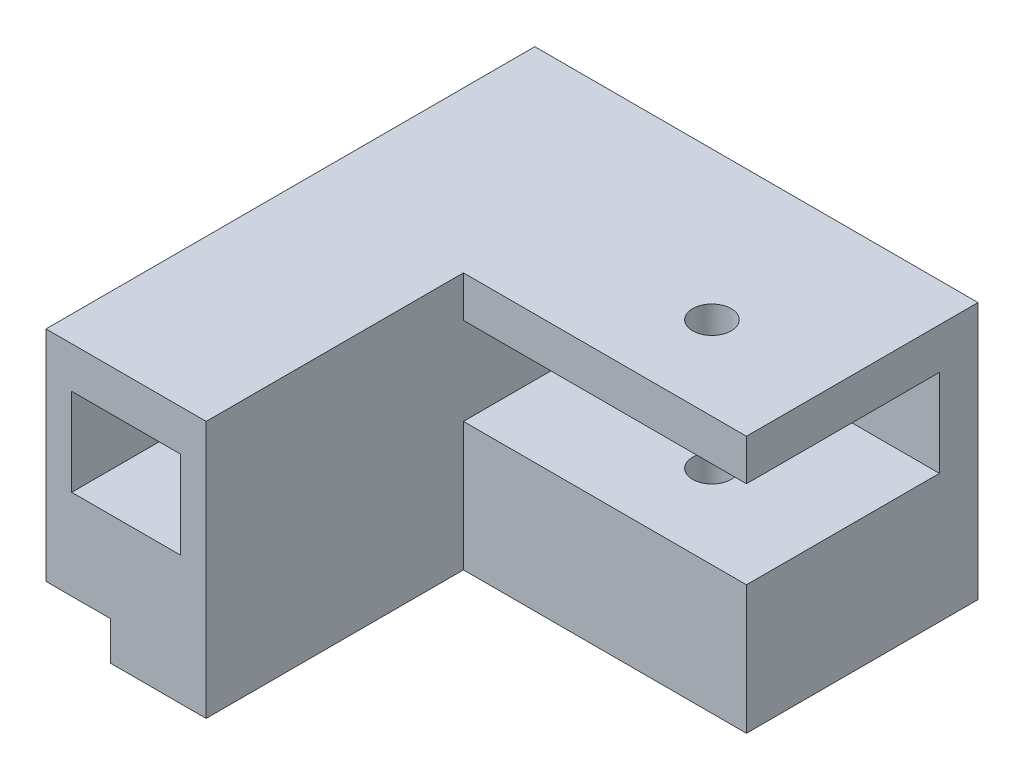
ISO-10303-21;
HEADER;
FILE_DESCRIPTION(('STEP AP214'),'2;1');
FILE_NAME('part.step','',(''),(''),'','','');
FILE_SCHEMA(('AUTOMOTIVE_DESIGN { 1 0 10303 214 1 1 1 1 }'));
ENDSEC;
DATA;
#1=APPLICATION_CONTEXT('core data for automotive mechanical design processes');
#2=APPLICATION_PROTOCOL_DEFINITION('international standard','automotive_design',2000,#1);
#3=PRODUCT_CONTEXT('',#1,'mechanical');
#4=PRODUCT('Part','Part','',(#3));
#5=PRODUCT_RELATED_PRODUCT_CATEGORY('part','',(#4));
#6=PRODUCT_DEFINITION_FORMATION('','',#4);
#7=PRODUCT_DEFINITION_CONTEXT('part definition',#1,'design');
#8=PRODUCT_DEFINITION('design','',#6,#7);
#9=PRODUCT_DEFINITION_SHAPE('','',#8);
#10=(LENGTH_UNIT() NAMED_UNIT(*) SI_UNIT(.MILLI.,.METRE.));
#11=(NAMED_UNIT(*) PLANE_ANGLE_UNIT() SI_UNIT($,.RADIAN.));
#12=(NAMED_UNIT(*) SI_UNIT($,.STERADIAN.) SOLID_ANGLE_UNIT());
#13=UNCERTAINTY_MEASURE_WITH_UNIT(LENGTH_MEASURE(1.E-05),#10,'distance_accuracy_value','');
#14=(GEOMETRIC_REPRESENTATION_CONTEXT(3) GLOBAL_UNCERTAINTY_ASSIGNED_CONTEXT((#13)) GLOBAL_UNIT_ASSIGNED_CONTEXT((#10,
#11,#12)) REPRESENTATION_CONTEXT('',''));
#15=CARTESIAN_POINT('',(0.,0.,0.));
#16=DIRECTION('',(0.,0.,1.));
#17=DIRECTION('',(1.,0.,0.));
#18=AXIS2_PLACEMENT_3D('',#15,#16,#17);
#19=CARTESIAN_POINT('',(0.,5.,18.));
#20=DIRECTION('',(0.,1.,0.));
#21=DIRECTION('',(0.,0.,-1.));
#22=AXIS2_PLACEMENT_3D('',#19,#20,#21);
#23=PLANE('',#22);
#24=DIRECTION('',(-1.,0.,0.));
#25=VECTOR('',#24,1.);
#26=CARTESIAN_POINT('',(0.,5.,15.9436413169626));
#27=LINE('',#26,#25);
#28=CARTESIAN_POINT('',(-4.375,4.99999999986514,15.9436413171899));
#29=VERTEX_POINT('',#28);
#30=CARTESIAN_POINT('',(-12.825,4.99999999995493,15.9436413170386));
#31=VERTEX_POINT('',#30);
#32=EDGE_CURVE('E212',#29,#31,#27,.T.);
#33=ORIENTED_EDGE('',*,*,#32,.T.);
#34=DIRECTION('',(0.,0.,1.));
#35=VECTOR('',#34,1.);
#36=CARTESIAN_POINT('',(-12.825,5.,38.));
#37=LINE('',#36,#35);
#38=CARTESIAN_POINT('',(-12.825,5.,38.));
#39=VERTEX_POINT('',#38);
#40=EDGE_CURVE('E252',#31,#39,#37,.T.);
#41=ORIENTED_EDGE('',*,*,#40,.T.);
#42=DIRECTION('',(-1.,0.,0.));
#43=VECTOR('',#42,1.);
#44=CARTESIAN_POINT('',(0.,5.,38.));
#45=LINE('',#44,#43);
#46=CARTESIAN_POINT('',(-4.375,5.,38.));
#47=VERTEX_POINT('',#46);
#48=EDGE_CURVE('E361',#47,#39,#45,.T.);
#49=ORIENTED_EDGE('',*,*,#48,.F.);
#50=DIRECTION('',(0.,0.,-1.));
#51=VECTOR('',#50,1.);
#52=CARTESIAN_POINT('',(-4.37500000000001,5.,38.));
#53=LINE('',#52,#51);
#54=EDGE_CURVE('E293',#47,#29,#53,.T.);
#55=ORIENTED_EDGE('',*,*,#54,.T.);
#56=EDGE_LOOP('',(#33,#41,#49,#55));
#57=FACE_BOUND('',#56,.T.);
#58=ADVANCED_FACE('F37',(#57),#23,.T.);
#59=CARTESIAN_POINT('',(10.44201924,5.,11.5));
#60=DIRECTION('',(0.,-1.,0.));
#61=DIRECTION('',(0.,0.,-1.));
#62=AXIS2_PLACEMENT_3D('',#59,#60,#61);
#63=CIRCLE('',#62,1.5);
#64=CARTESIAN_POINT('',(10.44201924,5.,10.));
#65=VERTEX_POINT('',#64);
#66=EDGE_CURVE('E323',#65,#65,#63,.F.);
#67=ORIENTED_EDGE('',*,*,#66,.F.);
#68=EDGE_LOOP('',(#67));
#69=FACE_BOUND('',#68,.T.);
#70=DIRECTION('',(0.,0.,-1.));
#71=VECTOR('',#70,1.);
#72=CARTESIAN_POINT('',(12.125,4.99999999999545,0.));
#73=LINE('',#72,#71);
#74=CARTESIAN_POINT('',(12.125,4.99999999999545,3.));
#75=VERTEX_POINT('',#74);
#76=CARTESIAN_POINT('',(12.125,4.99999999999545,0.));
#77=VERTEX_POINT('',#76);
#78=EDGE_CURVE('E249',#75,#77,#73,.T.);
#79=ORIENTED_EDGE('',*,*,#78,.T.);
#80=DIRECTION('',(-1.,0.,0.));
#81=VECTOR('',#80,1.);
#82=CARTESIAN_POINT('',(0.,5.,0.));
#83=LINE('',#82,#81);
#84=CARTESIAN_POINT('',(-2.375,5.,0.));
#85=VERTEX_POINT('',#84);
#86=EDGE_CURVE('E380',#77,#85,#83,.T.);
#87=ORIENTED_EDGE('',*,*,#86,.T.);
#88=DIRECTION('',(0.,0.,1.));
#89=VECTOR('',#88,1.);
#90=CARTESIAN_POINT('',(-2.37500000000001,5.,38.));
#91=LINE('',#90,#89);
#92=CARTESIAN_POINT('',(-2.375,5.,18.));
#93=VERTEX_POINT('',#92);
#94=EDGE_CURVE('E316',#85,#93,#91,.T.);
#95=ORIENTED_EDGE('',*,*,#94,.T.);
#96=DIRECTION('',(-1.,0.,0.));
#97=VECTOR('',#96,1.);
#98=CARTESIAN_POINT('',(0.,5.,18.));
#99=LINE('',#98,#97);
#100=CARTESIAN_POINT('',(19.625,5.,18.));
#101=VERTEX_POINT('',#100);
#102=EDGE_CURVE('E460',#101,#93,#99,.T.);
#103=ORIENTED_EDGE('',*,*,#102,.F.);
#104=DIRECTION('',(0.,0.,-1.));
#105=VECTOR('',#104,1.);
#106=CARTESIAN_POINT('',(19.625,5.,0.));
#107=LINE('',#106,#105);
#108=CARTESIAN_POINT('',(19.625,4.99999999999545,3.));
#109=VERTEX_POINT('',#108);
#110=EDGE_CURVE('E333',#101,#109,#107,.T.);
#111=ORIENTED_EDGE('',*,*,#110,.T.);
#112=DIRECTION('',(-1.,0.,0.));
#113=VECTOR('',#112,1.);
#114=CARTESIAN_POINT('',(19.625,4.99999999999545,3.));
#115=LINE('',#114,#113);
#116=EDGE_CURVE('E246',#109,#75,#115,.T.);
#117=ORIENTED_EDGE('',*,*,#116,.T.);
#118=EDGE_LOOP('',(#79,#87,#95,#103,#111,#117));
#119=FACE_BOUND('',#118,.T.);
#120=ADVANCED_FACE('F471',(#69,#119),#23,.T.);
#121=CARTESIAN_POINT('',(0.,11.8,18.));
#122=DIRECTION('',(0.,1.,0.));
#123=DIRECTION('',(0.,0.,-1.));
#124=AXIS2_PLACEMENT_3D('',#121,#122,#123);
#125=PLANE('',#124);
#126=CARTESIAN_POINT('',(10.44201924,11.8,11.5));
#127=DIRECTION('',(0.,-1.,0.));
#128=DIRECTION('',(0.,0.,-1.));
#129=AXIS2_PLACEMENT_3D('',#126,#127,#128);
#130=CIRCLE('',#129,1.5);
#131=CARTESIAN_POINT('',(10.44201924,11.8,10.));
#132=VERTEX_POINT('',#131);
#133=EDGE_CURVE('E265',#132,#132,#130,.F.);
#134=ORIENTED_EDGE('',*,*,#133,.T.);
#135=EDGE_LOOP('',(#134));
#136=FACE_BOUND('',#135,.T.);
#137=DIRECTION('',(1.,0.,0.));
#138=VECTOR('',#137,1.);
#139=CARTESIAN_POINT('',(19.625,11.8,3.));
#140=LINE('',#139,#138);
#141=CARTESIAN_POINT('',(12.125,11.8,3.));
#142=VERTEX_POINT('',#141);
#143=CARTESIAN_POINT('',(19.625,11.8,3.));
#144=VERTEX_POINT('',#143);
#145=EDGE_CURVE('E233',#142,#144,#140,.T.);
#146=ORIENTED_EDGE('',*,*,#145,.T.);
#147=DIRECTION('',(0.,0.,1.));
#148=VECTOR('',#147,1.);
#149=CARTESIAN_POINT('',(19.625,11.8,0.));
#150=LINE('',#149,#148);
#151=CARTESIAN_POINT('',(19.625,11.8,18.));
#152=VERTEX_POINT('',#151);
#153=EDGE_CURVE('E268',#144,#152,#150,.T.);
#154=ORIENTED_EDGE('',*,*,#153,.T.);
#155=DIRECTION('',(-1.,0.,0.));
#156=VECTOR('',#155,1.);
#157=CARTESIAN_POINT('',(0.,11.8,18.));
#158=LINE('',#157,#156);
#159=CARTESIAN_POINT('',(-2.375,11.7999999999938,18.));
#160=VERTEX_POINT('',#159);
#161=EDGE_CURVE('E426',#152,#160,#158,.T.);
#162=ORIENTED_EDGE('',*,*,#161,.T.);
#163=DIRECTION('',(0.,0.,1.));
#164=VECTOR('',#163,1.);
#165=CARTESIAN_POINT('',(-2.37500000000001,11.7999999999938,38.));
#166=LINE('',#165,#164);
#167=CARTESIAN_POINT('',(-2.375,11.7999999999938,0.));
#168=VERTEX_POINT('',#167);
#169=EDGE_CURVE('E301',#168,#160,#166,.T.);
#170=ORIENTED_EDGE('',*,*,#169,.F.);
#171=DIRECTION('',(-1.,0.,0.));
#172=VECTOR('',#171,1.);
#173=CARTESIAN_POINT('',(0.,11.8,0.));
#174=LINE('',#173,#172);
#175=CARTESIAN_POINT('',(12.125,11.8,0.));
#176=VERTEX_POINT('',#175);
#177=EDGE_CURVE('E404',#176,#168,#174,.T.);
#178=ORIENTED_EDGE('',*,*,#177,.F.);
#179=DIRECTION('',(0.,0.,1.));
#180=VECTOR('',#179,1.);
#181=CARTESIAN_POINT('',(12.125,11.8,0.));
#182=LINE('',#181,#180);
#183=EDGE_CURVE('E236',#176,#142,#182,.T.);
#184=ORIENTED_EDGE('',*,*,#183,.T.);
#185=EDGE_LOOP('',(#146,#154,#162,#170,#178,#184));
#186=FACE_BOUND('',#185,.T.);
#187=ADVANCED_FACE('F490',(#136,#186),#125,.F.);
#188=DIRECTION('',(-1.,0.,0.));
#189=VECTOR('',#188,1.);
#190=CARTESIAN_POINT('',(11.4417453763892,5.,3.61207246935829));
#191=LINE('',#190,#189);
#192=CARTESIAN_POINT('',(-12.825,5.,3.61207246935829));
#193=VERTEX_POINT('',#192);
#194=CARTESIAN_POINT('',(-4.375,5.,3.61207246935829));
#195=VERTEX_POINT('',#194);
#196=EDGE_CURVE('E225',#193,#195,#191,.F.);
#197=ORIENTED_EDGE('',*,*,#196,.T.);
#198=CARTESIAN_POINT('',(-4.375,5.,0.));
#199=VERTEX_POINT('',#198);
#200=EDGE_CURVE('E41',#195,#199,#53,.T.);
#201=ORIENTED_EDGE('',*,*,#200,.T.);
#202=CARTESIAN_POINT('',(-12.825,5.,0.));
#203=VERTEX_POINT('',#202);
#204=EDGE_CURVE('E369',#199,#203,#83,.T.);
#205=ORIENTED_EDGE('',*,*,#204,.T.);
#206=EDGE_CURVE('E253',#203,#193,#37,.T.);
#207=ORIENTED_EDGE('',*,*,#206,.T.);
#208=EDGE_LOOP('',(#197,#201,#205,#207));
#209=FACE_BOUND('',#208,.T.);
#210=ADVANCED_FACE('F39',(#209),#23,.T.);
#211=DIRECTION('',(0.,0.,1.));
#212=VECTOR('',#211,1.);
#213=CARTESIAN_POINT('',(-12.825,11.7999999999938,38.));
#214=LINE('',#213,#212);
#215=CARTESIAN_POINT('',(-12.825,11.7999999999938,0.));
#216=VERTEX_POINT('',#215);
#217=CARTESIAN_POINT('',(-12.825,11.7999999999938,38.));
#218=VERTEX_POINT('',#217);
#219=EDGE_CURVE('E258',#216,#218,#214,.T.);
#220=ORIENTED_EDGE('',*,*,#219,.F.);
#221=CARTESIAN_POINT('',(-4.375,11.8,0.));
#222=VERTEX_POINT('',#221);
#223=EDGE_CURVE('E284',#222,#216,#174,.T.);
#224=ORIENTED_EDGE('',*,*,#223,.F.);
#225=DIRECTION('',(0.,0.,-1.));
#226=VECTOR('',#225,1.);
#227=CARTESIAN_POINT('',(-4.37500000000001,11.7999999999938,38.));
#228=LINE('',#227,#226);
#229=CARTESIAN_POINT('',(-4.37500000000001,11.7999999999938,38.));
#230=VERTEX_POINT('',#229);
#231=EDGE_CURVE('E311',#230,#222,#228,.T.);
#232=ORIENTED_EDGE('',*,*,#231,.F.);
#233=DIRECTION('',(-1.,0.,0.));
#234=VECTOR('',#233,1.);
#235=CARTESIAN_POINT('',(0.,11.8,38.));
#236=LINE('',#235,#234);
#237=EDGE_CURVE('E276',#230,#218,#236,.T.);
#238=ORIENTED_EDGE('',*,*,#237,.T.);
#239=EDGE_LOOP('',(#220,#224,#232,#238));
#240=FACE_BOUND('',#239,.T.);
#241=ADVANCED_FACE('F403',(#240),#125,.F.);
#242=CARTESIAN_POINT('',(0.,-2.,38.));
#243=DIRECTION('',(0.,-1.,0.));
#244=DIRECTION('',(0.,0.,1.));
#245=AXIS2_PLACEMENT_3D('',#242,#243,#244);
#246=PLANE('',#245);
#247=DIRECTION('',(0.,0.,-1.));
#248=VECTOR('',#247,1.);
#249=CARTESIAN_POINT('',(-9.825,-2.,38.));
#250=LINE('',#249,#248);
#251=CARTESIAN_POINT('',(-9.825,-2.,38.));
#252=VERTEX_POINT('',#251);
#253=CARTESIAN_POINT('',(-9.825,-2.,10.));
#254=VERTEX_POINT('',#253);
#255=EDGE_CURVE('E455',#252,#254,#250,.T.);
#256=ORIENTED_EDGE('',*,*,#255,.F.);
#257=DIRECTION('',(1.,0.,0.));
#258=VECTOR('',#257,1.);
#259=CARTESIAN_POINT('',(0.,-2.,38.));
#260=LINE('',#259,#258);
#261=CARTESIAN_POINT('',(-14.825,-2.,38.));
#262=VERTEX_POINT('',#261);
#263=EDGE_CURVE('E351',#262,#252,#260,.T.);
#264=ORIENTED_EDGE('',*,*,#263,.F.);
#265=DIRECTION('',(0.,0.,-1.));
#266=VECTOR('',#265,1.);
#267=CARTESIAN_POINT('',(-14.825,-2.,38.));
#268=LINE('',#267,#266);
#269=CARTESIAN_POINT('',(-14.825,-2.,10.));
#270=VERTEX_POINT('',#269);
#271=EDGE_CURVE('E381',#262,#270,#268,.T.);
#272=ORIENTED_EDGE('',*,*,#271,.T.);
#273=DIRECTION('',(1.,0.,0.));
#274=VECTOR('',#273,1.);
#275=CARTESIAN_POINT('',(0.,-2.,10.));
#276=LINE('',#275,#274);
#277=EDGE_CURVE('E339',#270,#254,#276,.T.);
#278=ORIENTED_EDGE('',*,*,#277,.T.);
#279=EDGE_LOOP('',(#256,#264,#272,#278));
#280=FACE_BOUND('',#279,.T.);
#281=ADVANCED_FACE('F507',(#280),#246,.T.);
#282=CARTESIAN_POINT('',(-9.825,0.,38.));
#283=DIRECTION('',(-1.,0.,0.));
#284=DIRECTION('',(0.,0.,-1.));
#285=AXIS2_PLACEMENT_3D('',#282,#283,#284);
#286=PLANE('',#285);
#287=DIRECTION('',(0.,0.,-1.));
#288=VECTOR('',#287,1.);
#289=CARTESIAN_POINT('',(-9.825,-5.,38.));
#290=LINE('',#289,#288);
#291=CARTESIAN_POINT('',(-9.825,-5.,38.));
#292=VERTEX_POINT('',#291);
#293=CARTESIAN_POINT('',(-9.825,-5.,10.));
#294=VERTEX_POINT('',#293);
#295=EDGE_CURVE('E450',#292,#294,#290,.T.);
#296=ORIENTED_EDGE('',*,*,#295,.F.);
#297=DIRECTION('',(0.,-1.,0.));
#298=VECTOR('',#297,1.);
#299=CARTESIAN_POINT('',(-9.825,0.,38.));
#300=LINE('',#299,#298);
#301=EDGE_CURVE('E354',#252,#292,#300,.T.);
#302=ORIENTED_EDGE('',*,*,#301,.F.);
#303=ORIENTED_EDGE('',*,*,#255,.T.);
#304=DIRECTION('',(0.,-1.,0.));
#305=VECTOR('',#304,1.);
#306=CARTESIAN_POINT('',(-9.825,0.,10.));
#307=LINE('',#306,#305);
#308=EDGE_CURVE('E336',#254,#294,#307,.T.);
#309=ORIENTED_EDGE('',*,*,#308,.T.);
#310=EDGE_LOOP('',(#296,#302,#303,#309));
#311=FACE_BOUND('',#310,.T.);
#312=ADVANCED_FACE('F510',(#311),#286,.T.);
#313=CARTESIAN_POINT('',(0.,-5.,18.));
#314=DIRECTION('',(0.,1.,0.));
#315=DIRECTION('',(-1.,0.,0.));
#316=AXIS2_PLACEMENT_3D('',#313,#314,#315);
#317=PLANE('',#316);
#318=CARTESIAN_POINT('',(10.44201924,-5.,11.5));
#319=DIRECTION('',(0.,-1.,0.));
#320=DIRECTION('',(-1.,0.,0.));
#321=AXIS2_PLACEMENT_3D('',#318,#319,#320);
#322=CIRCLE('',#321,1.5);
#323=CARTESIAN_POINT('',(8.94201924000001,-5.,11.5));
#324=VERTEX_POINT('',#323);
#325=EDGE_CURVE('E320',#324,#324,#322,.F.);
#326=ORIENTED_EDGE('',*,*,#325,.T.);
#327=EDGE_LOOP('',(#326));
#328=FACE_BOUND('',#327,.T.);
#329=DIRECTION('',(-1.,0.,0.));
#330=VECTOR('',#329,1.);
#331=CARTESIAN_POINT('',(0.,-5.,0.));
#332=LINE('',#331,#330);
#333=CARTESIAN_POINT('',(19.625,-5.,0.));
#334=VERTEX_POINT('',#333);
#335=CARTESIAN_POINT('',(-14.825,-5.,0.));
#336=VERTEX_POINT('',#335);
#337=EDGE_CURVE('E442',#334,#336,#332,.T.);
#338=ORIENTED_EDGE('',*,*,#337,.F.);
#339=DIRECTION('',(0.,0.,1.));
#340=VECTOR('',#339,1.);
#341=CARTESIAN_POINT('',(19.625,-5.,0.));
#342=LINE('',#341,#340);
#343=CARTESIAN_POINT('',(19.625,-5.,18.));
#344=VERTEX_POINT('',#343);
#345=EDGE_CURVE('E328',#334,#344,#342,.T.);
#346=ORIENTED_EDGE('',*,*,#345,.T.);
#347=DIRECTION('',(-1.,0.,0.));
#348=VECTOR('',#347,1.);
#349=CARTESIAN_POINT('',(0.,-5.,18.));
#350=LINE('',#349,#348);
#351=CARTESIAN_POINT('',(-2.375,-5.,18.));
#352=VERTEX_POINT('',#351);
#353=EDGE_CURVE('E11',#344,#352,#350,.T.);
#354=ORIENTED_EDGE('',*,*,#353,.T.);
#355=DIRECTION('',(0.,0.,-1.));
#356=VECTOR('',#355,1.);
#357=CARTESIAN_POINT('',(-2.375,-5.,38.));
#358=LINE('',#357,#356);
#359=CARTESIAN_POINT('',(-2.375,-5.,38.));
#360=VERTEX_POINT('',#359);
#361=EDGE_CURVE('E447',#360,#352,#358,.T.);
#362=ORIENTED_EDGE('',*,*,#361,.F.);
#363=DIRECTION('',(-1.,0.,0.));
#364=VECTOR('',#363,1.);
#365=CARTESIAN_POINT('',(0.,-5.,38.));
#366=LINE('',#365,#364);
#367=EDGE_CURVE('E357',#360,#292,#366,.T.);
#368=ORIENTED_EDGE('',*,*,#367,.T.);
#369=ORIENTED_EDGE('',*,*,#295,.T.);
#370=DIRECTION('',(-1.,0.,0.));
#371=VECTOR('',#370,1.);
#372=CARTESIAN_POINT('',(0.,-5.,10.));
#373=LINE('',#372,#371);
#374=CARTESIAN_POINT('',(-14.825,-5.,10.));
#375=VERTEX_POINT('',#374);
#376=EDGE_CURVE('E344',#294,#375,#373,.T.);
#377=ORIENTED_EDGE('',*,*,#376,.T.);
#378=DIRECTION('',(0.,0.,-1.));
#379=VECTOR('',#378,1.);
#380=CARTESIAN_POINT('',(-14.825,-5.,10.));
#381=LINE('',#380,#379);
#382=EDGE_CURVE('E347',#375,#336,#381,.T.);
#383=ORIENTED_EDGE('',*,*,#382,.T.);
#384=EDGE_LOOP('',(#338,#346,#354,#362,#368,#369,#377,#383));
#385=FACE_BOUND('',#384,.T.);
#386=ADVANCED_FACE('F485',(#328,#385),#317,.F.);
#387=CARTESIAN_POINT('',(0.,0.,18.));
#388=DIRECTION('',(0.,0.,-1.));
#389=DIRECTION('',(1.,0.,0.));
#390=AXIS2_PLACEMENT_3D('',#387,#388,#389);
#391=PLANE('',#390);
#392=ORIENTED_EDGE('',*,*,#102,.T.);
#393=DIRECTION('',(0.,-1.,0.));
#394=VECTOR('',#393,1.);
#395=CARTESIAN_POINT('',(-2.375,0.,18.));
#396=LINE('',#395,#394);
#397=EDGE_CURVE('E47',#93,#352,#396,.T.);
#398=ORIENTED_EDGE('',*,*,#397,.T.);
#399=ORIENTED_EDGE('',*,*,#353,.F.);
#400=DIRECTION('',(0.,1.,0.));
#401=VECTOR('',#400,1.);
#402=CARTESIAN_POINT('',(19.625,5.,18.));
#403=LINE('',#402,#401);
#404=EDGE_CURVE('E331',#344,#101,#403,.T.);
#405=ORIENTED_EDGE('',*,*,#404,.T.);
#406=EDGE_LOOP('',(#392,#398,#399,#405));
#407=FACE_BOUND('',#406,.T.);
#408=ADVANCED_FACE('F481',(#407),#391,.F.);
#409=CARTESIAN_POINT('',(0.,0.,0.));
#410=DIRECTION('',(0.,0.,-1.));
#411=DIRECTION('',(1.,0.,0.));
#412=AXIS2_PLACEMENT_3D('',#409,#410,#411);
#413=PLANE('',#412);
#414=DIRECTION('',(0.,1.,0.));
#415=VECTOR('',#414,1.);
#416=CARTESIAN_POINT('',(12.125,-500000.,0.));
#417=LINE('',#416,#415);
#418=EDGE_CURVE('E244',#77,#176,#417,.T.);
#419=ORIENTED_EDGE('',*,*,#418,.T.);
#420=ORIENTED_EDGE('',*,*,#177,.T.);
#421=DIRECTION('',(0.,-1.,0.));
#422=VECTOR('',#421,1.);
#423=CARTESIAN_POINT('',(-2.37500000005515,500000.,0.));
#424=LINE('',#423,#422);
#425=EDGE_CURVE('E296',#168,#85,#424,.T.);
#426=ORIENTED_EDGE('',*,*,#425,.T.);
#427=ORIENTED_EDGE('',*,*,#86,.F.);
#428=EDGE_LOOP('',(#419,#420,#426,#427));
#429=FACE_BOUND('',#428,.T.);
#430=ORIENTED_EDGE('',*,*,#204,.F.);
#431=DIRECTION('',(0.,-1.,0.));
#432=VECTOR('',#431,1.);
#433=CARTESIAN_POINT('',(-4.37500000005515,500000.,0.));
#434=LINE('',#433,#432);
#435=EDGE_CURVE('E302',#222,#199,#434,.T.);
#436=ORIENTED_EDGE('',*,*,#435,.F.);
#437=ORIENTED_EDGE('',*,*,#223,.T.);
#438=DIRECTION('',(0.,-1.,0.));
#439=VECTOR('',#438,1.);
#440=CARTESIAN_POINT('',(-12.8250000000552,500000.,0.));
#441=LINE('',#440,#439);
#442=EDGE_CURVE('E63',#216,#203,#441,.T.);
#443=ORIENTED_EDGE('',*,*,#442,.T.);
#444=EDGE_LOOP('',(#430,#436,#437,#443));
#445=FACE_BOUND('',#444,.T.);
#446=DIRECTION('',(0.,-1.,0.));
#447=VECTOR('',#446,1.);
#448=CARTESIAN_POINT('',(19.625,5.,0.));
#449=LINE('',#448,#447);
#450=CARTESIAN_POINT('',(19.625,15.,0.));
#451=VERTEX_POINT('',#450);
#452=EDGE_CURVE('E326',#451,#334,#449,.T.);
#453=ORIENTED_EDGE('',*,*,#452,.T.);
#454=ORIENTED_EDGE('',*,*,#337,.T.);
#455=DIRECTION('',(0.,1.,0.));
#456=VECTOR('',#455,1.);
#457=CARTESIAN_POINT('',(-14.825,0.,0.));
#458=LINE('',#457,#456);
#459=CARTESIAN_POINT('',(-14.825,15.,0.));
#460=VERTEX_POINT('',#459);
#461=EDGE_CURVE('E350',#336,#460,#458,.T.);
#462=ORIENTED_EDGE('',*,*,#461,.T.);
#463=DIRECTION('',(-1.,0.,0.));
#464=VECTOR('',#463,1.);
#465=CARTESIAN_POINT('',(0.,15.,0.));
#466=LINE('',#465,#464);
#467=EDGE_CURVE('E407',#451,#460,#466,.T.);
#468=ORIENTED_EDGE('',*,*,#467,.F.);
#469=EDGE_LOOP('',(#453,#454,#462,#468));
#470=FACE_BOUND('',#469,.T.);
#471=ADVANCED_FACE('F377',(#429,#445,#470),#413,.T.);
#472=CARTESIAN_POINT('',(-2.375,0.,38.));
#473=DIRECTION('',(-1.,0.,0.));
#474=DIRECTION('',(0.,-1.,0.));
#475=AXIS2_PLACEMENT_3D('',#472,#473,#474);
#476=PLANE('',#475);
#477=DIRECTION('',(0.,-1.,0.));
#478=VECTOR('',#477,1.);
#479=CARTESIAN_POINT('',(-2.375,0.,38.));
#480=LINE('',#479,#478);
#481=CARTESIAN_POINT('',(-2.375,15.,38.));
#482=VERTEX_POINT('',#481);
#483=EDGE_CURVE('E359',#482,#360,#480,.T.);
#484=ORIENTED_EDGE('',*,*,#483,.T.);
#485=ORIENTED_EDGE('',*,*,#361,.T.);
#486=ORIENTED_EDGE('',*,*,#397,.F.);
#487=ORIENTED_EDGE('',*,*,#94,.F.);
#488=ORIENTED_EDGE('',*,*,#425,.F.);
#489=ORIENTED_EDGE('',*,*,#169,.T.);
#490=DIRECTION('',(0.,1.,0.));
#491=VECTOR('',#490,1.);
#492=CARTESIAN_POINT('',(-2.375,0.,18.));
#493=LINE('',#492,#491);
#494=CARTESIAN_POINT('',(-2.375,15.,18.));
#495=VERTEX_POINT('',#494);
#496=EDGE_CURVE('E319',#160,#495,#493,.T.);
#497=ORIENTED_EDGE('',*,*,#496,.T.);
#498=DIRECTION('',(0.,0.,-1.));
#499=VECTOR('',#498,1.);
#500=CARTESIAN_POINT('',(-2.375,15.,38.));
#501=LINE('',#500,#499);
#502=EDGE_CURVE('E408',#482,#495,#501,.T.);
#503=ORIENTED_EDGE('',*,*,#502,.F.);
#504=EDGE_LOOP('',(#484,#485,#486,#487,#488,#489,#497,#503));
#505=FACE_BOUND('',#504,.T.);
#506=ADVANCED_FACE('F478',(#505),#476,.F.);
#507=CARTESIAN_POINT('',(-14.825,0.,38.));
#508=DIRECTION('',(1.,0.,0.));
#509=DIRECTION('',(0.,0.,1.));
#510=AXIS2_PLACEMENT_3D('',#507,#508,#509);
#511=PLANE('',#510);
#512=CARTESIAN_POINT('',(-14.825,4.60953503060943,8.09510014133165));
#513=DIRECTION('',(1.,0.,0.));
#514=DIRECTION('',(0.,-1.,0.));
#515=AXIS2_PLACEMENT_3D('',#512,#513,#514);
#516=CIRCLE('',#515,2.);
#517=CARTESIAN_POINT('',(-14.825,2.60953503060943,8.09510014133165));
#518=VERTEX_POINT('',#517);
#519=EDGE_CURVE('E229',#518,#518,#516,.T.);
#520=ORIENTED_EDGE('',*,*,#519,.T.);
#521=EDGE_LOOP('',(#520));
#522=FACE_BOUND('',#521,.T.);
#523=ORIENTED_EDGE('',*,*,#461,.F.);
#524=ORIENTED_EDGE('',*,*,#382,.F.);
#525=DIRECTION('',(0.,1.,0.));
#526=VECTOR('',#525,1.);
#527=CARTESIAN_POINT('',(-14.825,0.,10.));
#528=LINE('',#527,#526);
#529=EDGE_CURVE('E342',#375,#270,#528,.T.);
#530=ORIENTED_EDGE('',*,*,#529,.T.);
#531=ORIENTED_EDGE('',*,*,#271,.F.);
#532=DIRECTION('',(0.,1.,0.));
#533=VECTOR('',#532,1.);
#534=CARTESIAN_POINT('',(-14.825,0.,38.));
#535=LINE('',#534,#533);
#536=CARTESIAN_POINT('',(-14.825,15.,38.));
#537=VERTEX_POINT('',#536);
#538=EDGE_CURVE('E364',#262,#537,#535,.T.);
#539=ORIENTED_EDGE('',*,*,#538,.T.);
#540=DIRECTION('',(0.,0.,-1.));
#541=VECTOR('',#540,1.);
#542=CARTESIAN_POINT('',(-14.825,15.,38.));
#543=LINE('',#542,#541);
#544=EDGE_CURVE('E405',#537,#460,#543,.T.);
#545=ORIENTED_EDGE('',*,*,#544,.T.);
#546=EDGE_LOOP('',(#523,#524,#530,#531,#539,#545));
#547=FACE_BOUND('',#546,.T.);
#548=ADVANCED_FACE('F503',(#522,#547),#511,.F.);
#549=CARTESIAN_POINT('',(0.,0.,38.));
#550=DIRECTION('',(0.,0.,-1.));
#551=DIRECTION('',(1.,0.,0.));
#552=AXIS2_PLACEMENT_3D('',#549,#550,#551);
#553=PLANE('',#552);
#554=ORIENTED_EDGE('',*,*,#538,.F.);
#555=ORIENTED_EDGE('',*,*,#263,.T.);
#556=ORIENTED_EDGE('',*,*,#301,.T.);
#557=ORIENTED_EDGE('',*,*,#367,.F.);
#558=ORIENTED_EDGE('',*,*,#483,.F.);
#559=DIRECTION('',(-1.,0.,0.));
#560=VECTOR('',#559,1.);
#561=CARTESIAN_POINT('',(0.,15.,38.));
#562=LINE('',#561,#560);
#563=EDGE_CURVE('E279',#482,#537,#562,.T.);
#564=ORIENTED_EDGE('',*,*,#563,.T.);
#565=EDGE_LOOP('',(#554,#555,#556,#557,#558,#564));
#566=FACE_BOUND('',#565,.T.);
#567=DIRECTION('',(0.,-1.,0.));
#568=VECTOR('',#567,1.);
#569=CARTESIAN_POINT('',(-12.8250000000552,500000.,38.));
#570=LINE('',#569,#568);
#571=EDGE_CURVE('E256',#218,#39,#570,.T.);
#572=ORIENTED_EDGE('',*,*,#571,.F.);
#573=ORIENTED_EDGE('',*,*,#237,.F.);
#574=DIRECTION('',(0.,-1.,0.));
#575=VECTOR('',#574,1.);
#576=CARTESIAN_POINT('',(-4.37500000005517,500000.,38.));
#577=LINE('',#576,#575);
#578=EDGE_CURVE('E299',#230,#47,#577,.T.);
#579=ORIENTED_EDGE('',*,*,#578,.T.);
#580=ORIENTED_EDGE('',*,*,#48,.T.);
#581=EDGE_LOOP('',(#572,#573,#579,#580));
#582=FACE_BOUND('',#581,.T.);
#583=ADVANCED_FACE('F400',(#566,#582),#553,.F.);
#584=CARTESIAN_POINT('',(0.,0.,10.));
#585=DIRECTION('',(0.,0.,-1.));
#586=DIRECTION('',(1.,0.,0.));
#587=AXIS2_PLACEMENT_3D('',#584,#585,#586);
#588=PLANE('',#587);
#589=ORIENTED_EDGE('',*,*,#308,.F.);
#590=ORIENTED_EDGE('',*,*,#277,.F.);
#591=ORIENTED_EDGE('',*,*,#529,.F.);
#592=ORIENTED_EDGE('',*,*,#376,.F.);
#593=EDGE_LOOP('',(#589,#590,#591,#592));
#594=FACE_BOUND('',#593,.T.);
#595=ADVANCED_FACE('F509',(#594),#588,.F.);
#596=CARTESIAN_POINT('',(19.625,0.,0.));
#597=DIRECTION('',(1.,0.,0.));
#598=DIRECTION('',(0.,0.,1.));
#599=AXIS2_PLACEMENT_3D('',#596,#597,#598);
#600=PLANE('',#599);
#601=ORIENTED_EDGE('',*,*,#452,.F.);
#602=DIRECTION('',(0.,0.,-1.));
#603=VECTOR('',#602,1.);
#604=CARTESIAN_POINT('',(19.625,15.,0.));
#605=LINE('',#604,#603);
#606=CARTESIAN_POINT('',(19.625,15.,18.));
#607=VERTEX_POINT('',#606);
#608=EDGE_CURVE('E274',#607,#451,#605,.T.);
#609=ORIENTED_EDGE('',*,*,#608,.F.);
#610=DIRECTION('',(0.,1.,0.));
#611=VECTOR('',#610,1.);
#612=CARTESIAN_POINT('',(19.625,15.,18.));
#613=LINE('',#612,#611);
#614=EDGE_CURVE('E271',#152,#607,#613,.T.);
#615=ORIENTED_EDGE('',*,*,#614,.F.);
#616=ORIENTED_EDGE('',*,*,#153,.F.);
#617=DIRECTION('',(0.,1.,0.));
#618=VECTOR('',#617,1.);
#619=CARTESIAN_POINT('',(19.625,-500000.,3.));
#620=LINE('',#619,#618);
#621=EDGE_CURVE('E55',#109,#144,#620,.T.);
#622=ORIENTED_EDGE('',*,*,#621,.F.);
#623=ORIENTED_EDGE('',*,*,#110,.F.);
#624=ORIENTED_EDGE('',*,*,#404,.F.);
#625=ORIENTED_EDGE('',*,*,#345,.F.);
#626=EDGE_LOOP('',(#601,#609,#615,#616,#622,#623,#624,#625));
#627=FACE_BOUND('',#626,.T.);
#628=ADVANCED_FACE('F487',(#627),#600,.T.);
#629=CARTESIAN_POINT('',(10.44201924,19.2426406871193,11.5));
#630=DIRECTION('',(0.,-1.,0.));
#631=DIRECTION('',(1.,0.,0.));
#632=AXIS2_PLACEMENT_3D('',#629,#630,#631);
#633=CYLINDRICAL_SURFACE('',#632,1.5);
#634=ORIENTED_EDGE('',*,*,#66,.T.);
#635=EDGE_LOOP('',(#634));
#636=FACE_BOUND('',#635,.T.);
#637=ORIENTED_EDGE('',*,*,#325,.F.);
#638=EDGE_LOOP('',(#637));
#639=FACE_BOUND('',#638,.T.);
#640=ADVANCED_FACE('F539',(#636,#639),#633,.F.);
#641=CARTESIAN_POINT('',(-4.37500000005517,500000.,38.));
#642=DIRECTION('',(1.,0.,0.));
#643=DIRECTION('',(0.,0.,1.));
#644=AXIS2_PLACEMENT_3D('',#641,#642,#643);
#645=PLANE('',#644);
#646=ORIENTED_EDGE('',*,*,#54,.F.);
#647=ORIENTED_EDGE('',*,*,#578,.F.);
#648=ORIENTED_EDGE('',*,*,#231,.T.);
#649=ORIENTED_EDGE('',*,*,#435,.T.);
#650=ORIENTED_EDGE('',*,*,#200,.F.);
#651=CARTESIAN_POINT('',(-4.375,4.60953503060943,8.09510014133165));
#652=DIRECTION('',(-1.,0.,0.));
#653=DIRECTION('',(0.,0.,1.));
#654=AXIS2_PLACEMENT_3D('',#651,#652,#653);
#655=CIRCLE('',#654,4.5);
#656=CARTESIAN_POINT('',(-4.375,0.271522618915901,9.29161521269217));
#657=VERTEX_POINT('',#656);
#658=EDGE_CURVE('E219',#657,#195,#655,.F.);
#659=ORIENTED_EDGE('',*,*,#658,.F.);
#660=DIRECTION('',(0.,-0.510338679358111,-0.859973506772749));
#661=VECTOR('',#660,1.);
#662=CARTESIAN_POINT('',(-4.375,-3.87707736384501,2.30079476408421));
#663=LINE('',#662,#661);
#664=CARTESIAN_POINT('',(-4.37499999999999,4.60953503060943,16.6016152126922));
#665=VERTEX_POINT('',#664);
#666=EDGE_CURVE('E201',#665,#657,#663,.T.);
#667=ORIENTED_EDGE('',*,*,#666,.F.);
#668=DIRECTION('',(0.,-0.510338679358111,0.859973506772749));
#669=VECTOR('',#668,1.);
#670=CARTESIAN_POINT('',(-4.375,10.695081489774,6.34683943183492));
#671=LINE('',#670,#669);
#672=EDGE_CURVE('E207',#29,#665,#671,.T.);
#673=ORIENTED_EDGE('',*,*,#672,.F.);
#674=EDGE_LOOP('',(#646,#647,#648,#649,#650,#659,#667,#673));
#675=FACE_BOUND('',#674,.T.);
#676=ADVANCED_FACE('F217',(#675),#645,.F.);
#677=CARTESIAN_POINT('',(0.,15.,18.));
#678=DIRECTION('',(0.,1.,0.));
#679=DIRECTION('',(-1.,0.,0.));
#680=AXIS2_PLACEMENT_3D('',#677,#678,#679);
#681=PLANE('',#680);
#682=CARTESIAN_POINT('',(10.44201924,15.,11.5));
#683=DIRECTION('',(0.,-1.,0.));
#684=DIRECTION('',(-1.,0.,0.));
#685=AXIS2_PLACEMENT_3D('',#682,#683,#684);
#686=CIRCLE('',#685,1.5);
#687=CARTESIAN_POINT('',(8.94201924,15.,11.5));
#688=VERTEX_POINT('',#687);
#689=EDGE_CURVE('E262',#688,#688,#686,.T.);
#690=ORIENTED_EDGE('',*,*,#689,.T.);
#691=EDGE_LOOP('',(#690));
#692=FACE_BOUND('',#691,.T.);
#693=ORIENTED_EDGE('',*,*,#467,.T.);
#694=ORIENTED_EDGE('',*,*,#544,.F.);
#695=ORIENTED_EDGE('',*,*,#563,.F.);
#696=ORIENTED_EDGE('',*,*,#502,.T.);
#697=DIRECTION('',(-1.,0.,0.));
#698=VECTOR('',#697,1.);
#699=CARTESIAN_POINT('',(0.,15.,18.));
#700=LINE('',#699,#698);
#701=EDGE_CURVE('E424',#607,#495,#700,.T.);
#702=ORIENTED_EDGE('',*,*,#701,.F.);
#703=ORIENTED_EDGE('',*,*,#608,.T.);
#704=EDGE_LOOP('',(#693,#694,#695,#696,#702,#703));
#705=FACE_BOUND('',#704,.T.);
#706=ADVANCED_FACE('F437',(#692,#705),#681,.T.);
#707=CARTESIAN_POINT('',(0.,0.,18.));
#708=DIRECTION('',(0.,0.,-1.));
#709=DIRECTION('',(1.,0.,0.));
#710=AXIS2_PLACEMENT_3D('',#707,#708,#709);
#711=PLANE('',#710);
#712=ORIENTED_EDGE('',*,*,#161,.F.);
#713=ORIENTED_EDGE('',*,*,#614,.T.);
#714=ORIENTED_EDGE('',*,*,#701,.T.);
#715=ORIENTED_EDGE('',*,*,#496,.F.);
#716=EDGE_LOOP('',(#712,#713,#714,#715));
#717=FACE_BOUND('',#716,.T.);
#718=ADVANCED_FACE('F494',(#717),#711,.F.);
#719=CARTESIAN_POINT('',(10.44201924,19.2426406871193,11.5));
#720=DIRECTION('',(0.,-1.,0.));
#721=DIRECTION('',(1.,0.,0.));
#722=AXIS2_PLACEMENT_3D('',#719,#720,#721);
#723=CYLINDRICAL_SURFACE('',#722,1.5);
#724=ORIENTED_EDGE('',*,*,#689,.F.);
#725=EDGE_LOOP('',(#724));
#726=FACE_BOUND('',#725,.T.);
#727=ORIENTED_EDGE('',*,*,#133,.F.);
#728=EDGE_LOOP('',(#727));
#729=FACE_BOUND('',#728,.T.);
#730=ADVANCED_FACE('F795',(#726,#729),#723,.F.);
#731=CARTESIAN_POINT('',(-12.8250000000552,500000.,38.));
#732=DIRECTION('',(-1.,0.,0.));
#733=DIRECTION('',(0.,-1.,0.));
#734=AXIS2_PLACEMENT_3D('',#731,#732,#733);
#735=PLANE('',#734);
#736=DIRECTION('',(0.,-0.510338679358111,0.859973506772749));
#737=VECTOR('',#736,1.);
#738=CARTESIAN_POINT('',(-12.825,10.695081489774,6.34683943183492));
#739=LINE('',#738,#737);
#740=CARTESIAN_POINT('',(-12.825,4.60953503060943,16.6016152126922));
#741=VERTEX_POINT('',#740);
#742=EDGE_CURVE('E388',#31,#741,#739,.T.);
#743=ORIENTED_EDGE('',*,*,#742,.T.);
#744=DIRECTION('',(0.,-0.510338679358111,-0.859973506772749));
#745=VECTOR('',#744,1.);
#746=CARTESIAN_POINT('',(-12.825,-3.87707736384501,2.30079476408422));
#747=LINE('',#746,#745);
#748=CARTESIAN_POINT('',(-12.825,0.271522618915901,9.29161521269217));
#749=VERTEX_POINT('',#748);
#750=EDGE_CURVE('E204',#741,#749,#747,.T.);
#751=ORIENTED_EDGE('',*,*,#750,.T.);
#752=CARTESIAN_POINT('',(-12.825,4.60953503060943,8.09510014133165));
#753=DIRECTION('',(1.,0.,0.));
#754=DIRECTION('',(0.,-1.,0.));
#755=AXIS2_PLACEMENT_3D('',#752,#753,#754);
#756=CIRCLE('',#755,4.5);
#757=EDGE_CURVE('E386',#749,#193,#756,.T.);
#758=ORIENTED_EDGE('',*,*,#757,.T.);
#759=ORIENTED_EDGE('',*,*,#206,.F.);
#760=ORIENTED_EDGE('',*,*,#442,.F.);
#761=ORIENTED_EDGE('',*,*,#219,.T.);
#762=ORIENTED_EDGE('',*,*,#571,.T.);
#763=ORIENTED_EDGE('',*,*,#40,.F.);
#764=EDGE_LOOP('',(#743,#751,#758,#759,#760,#761,#762,#763));
#765=FACE_BOUND('',#764,.T.);
#766=CARTESIAN_POINT('',(-12.825,4.60953503060943,8.09510014133165));
#767=DIRECTION('',(1.,0.,0.));
#768=DIRECTION('',(0.,-1.,0.));
#769=AXIS2_PLACEMENT_3D('',#766,#767,#768);
#770=CIRCLE('',#769,2.);
#771=CARTESIAN_POINT('',(-12.825,2.60953503060943,8.09510014133165));
#772=VERTEX_POINT('',#771);
#773=EDGE_CURVE('E230',#772,#772,#770,.T.);
#774=ORIENTED_EDGE('',*,*,#773,.F.);
#775=EDGE_LOOP('',(#774));
#776=FACE_BOUND('',#775,.T.);
#777=ADVANCED_FACE('F390',(#765,#776),#735,.F.);
#778=CARTESIAN_POINT('',(19.625,-500000.,3.));
#779=DIRECTION('',(0.,0.,-1.));
#780=DIRECTION('',(1.,0.,0.));
#781=AXIS2_PLACEMENT_3D('',#778,#779,#780);
#782=PLANE('',#781);
#783=ORIENTED_EDGE('',*,*,#621,.T.);
#784=ORIENTED_EDGE('',*,*,#145,.F.);
#785=DIRECTION('',(0.,1.,0.));
#786=VECTOR('',#785,1.);
#787=CARTESIAN_POINT('',(12.125,-500000.,3.));
#788=LINE('',#787,#786);
#789=EDGE_CURVE('E242',#75,#142,#788,.T.);
#790=ORIENTED_EDGE('',*,*,#789,.F.);
#791=ORIENTED_EDGE('',*,*,#116,.F.);
#792=EDGE_LOOP('',(#783,#784,#790,#791));
#793=FACE_BOUND('',#792,.T.);
#794=ADVANCED_FACE('F813',(#793),#782,.F.);
#795=CARTESIAN_POINT('',(12.125,-500000.,0.));
#796=DIRECTION('',(1.,0.,0.));
#797=DIRECTION('',(0.,0.,1.));
#798=AXIS2_PLACEMENT_3D('',#795,#796,#797);
#799=PLANE('',#798);
#800=ORIENTED_EDGE('',*,*,#789,.T.);
#801=ORIENTED_EDGE('',*,*,#183,.F.);
#802=ORIENTED_EDGE('',*,*,#418,.F.);
#803=ORIENTED_EDGE('',*,*,#78,.F.);
#804=EDGE_LOOP('',(#800,#801,#802,#803));
#805=FACE_BOUND('',#804,.T.);
#806=ADVANCED_FACE('F489',(#805),#799,.F.);
#807=CARTESIAN_POINT('',(-12.825,4.60953503060943,8.09510014133165));
#808=DIRECTION('',(-1.,0.,0.));
#809=DIRECTION('',(0.,-1.,0.));
#810=AXIS2_PLACEMENT_3D('',#807,#808,#809);
#811=CYLINDRICAL_SURFACE('',#810,2.);
#812=ORIENTED_EDGE('',*,*,#773,.T.);
#813=EDGE_LOOP('',(#812));
#814=FACE_BOUND('',#813,.T.);
#815=ORIENTED_EDGE('',*,*,#519,.F.);
#816=EDGE_LOOP('',(#815));
#817=FACE_BOUND('',#816,.T.);
#818=ADVANCED_FACE('F840',(#814,#817),#811,.F.);
#819=CARTESIAN_POINT('',(11.4417453763892,10.695081489774,6.34683943183492));
#820=DIRECTION('',(0.,0.859973506772749,0.510338679358111));
#821=DIRECTION('',(0.,0.510338679358111,-0.859973506772749));
#822=AXIS2_PLACEMENT_3D('',#819,#820,#821);
#823=PLANE('',#822);
#824=ORIENTED_EDGE('',*,*,#32,.F.);
#825=ORIENTED_EDGE('',*,*,#672,.T.);
#826=DIRECTION('',(-1.,0.,0.));
#827=VECTOR('',#826,1.);
#828=CARTESIAN_POINT('',(11.4417453763892,4.60953503060943,16.6016152126922));
#829=LINE('',#828,#827);
#830=EDGE_CURVE('E197',#665,#741,#829,.T.);
#831=ORIENTED_EDGE('',*,*,#830,.T.);
#832=ORIENTED_EDGE('',*,*,#742,.F.);
#833=EDGE_LOOP('',(#824,#825,#831,#832));
#834=FACE_BOUND('',#833,.T.);
#835=ADVANCED_FACE('F210',(#834),#823,.F.);
#836=CARTESIAN_POINT('',(11.4417453763892,-3.87707736384501,2.30079476408422));
#837=DIRECTION('',(0.,-0.859973506772749,0.510338679358111));
#838=DIRECTION('',(0.,0.510338679358111,0.859973506772749));
#839=AXIS2_PLACEMENT_3D('',#836,#837,#838);
#840=PLANE('',#839);
#841=ORIENTED_EDGE('',*,*,#830,.F.);
#842=ORIENTED_EDGE('',*,*,#666,.T.);
#843=DIRECTION('',(-1.,0.,0.));
#844=VECTOR('',#843,1.);
#845=CARTESIAN_POINT('',(11.4417453763892,0.271522618915901,9.29161521269217));
#846=LINE('',#845,#844);
#847=EDGE_CURVE('E220',#657,#749,#846,.T.);
#848=ORIENTED_EDGE('',*,*,#847,.T.);
#849=ORIENTED_EDGE('',*,*,#750,.F.);
#850=EDGE_LOOP('',(#841,#842,#848,#849));
#851=FACE_BOUND('',#850,.T.);
#852=ADVANCED_FACE('F199',(#851),#840,.F.);
#853=CARTESIAN_POINT('',(11.4417453763892,4.60953503060943,8.09510014133165));
#854=DIRECTION('',(-1.,0.,0.));
#855=DIRECTION('',(0.,0.,-1.));
#856=AXIS2_PLACEMENT_3D('',#853,#854,#855);
#857=CYLINDRICAL_SURFACE('',#856,4.5);
#858=ORIENTED_EDGE('',*,*,#196,.F.);
#859=ORIENTED_EDGE('',*,*,#757,.F.);
#860=ORIENTED_EDGE('',*,*,#847,.F.);
#861=ORIENTED_EDGE('',*,*,#658,.T.);
#862=EDGE_LOOP('',(#858,#859,#860,#861));
#863=FACE_BOUND('',#862,.T.);
#864=ADVANCED_FACE('F385',(#863),#857,.F.);
#865=CLOSED_SHELL('',(#58,#120,#187,#210,#241,#281,#312,#386,#408,#471,#506,#548,#583,#595,#628,
#640,#676,#706,#718,#730,#777,#794,#806,#818,#835,#852,#864));
#866=MANIFOLD_SOLID_BREP('B2',#865);
#867=ADVANCED_BREP_SHAPE_REPRESENTATION('',(#18,#866),#14);
#868=SHAPE_DEFINITION_REPRESENTATION(#9,#867);
ENDSEC;
END-ISO-10303-21;
